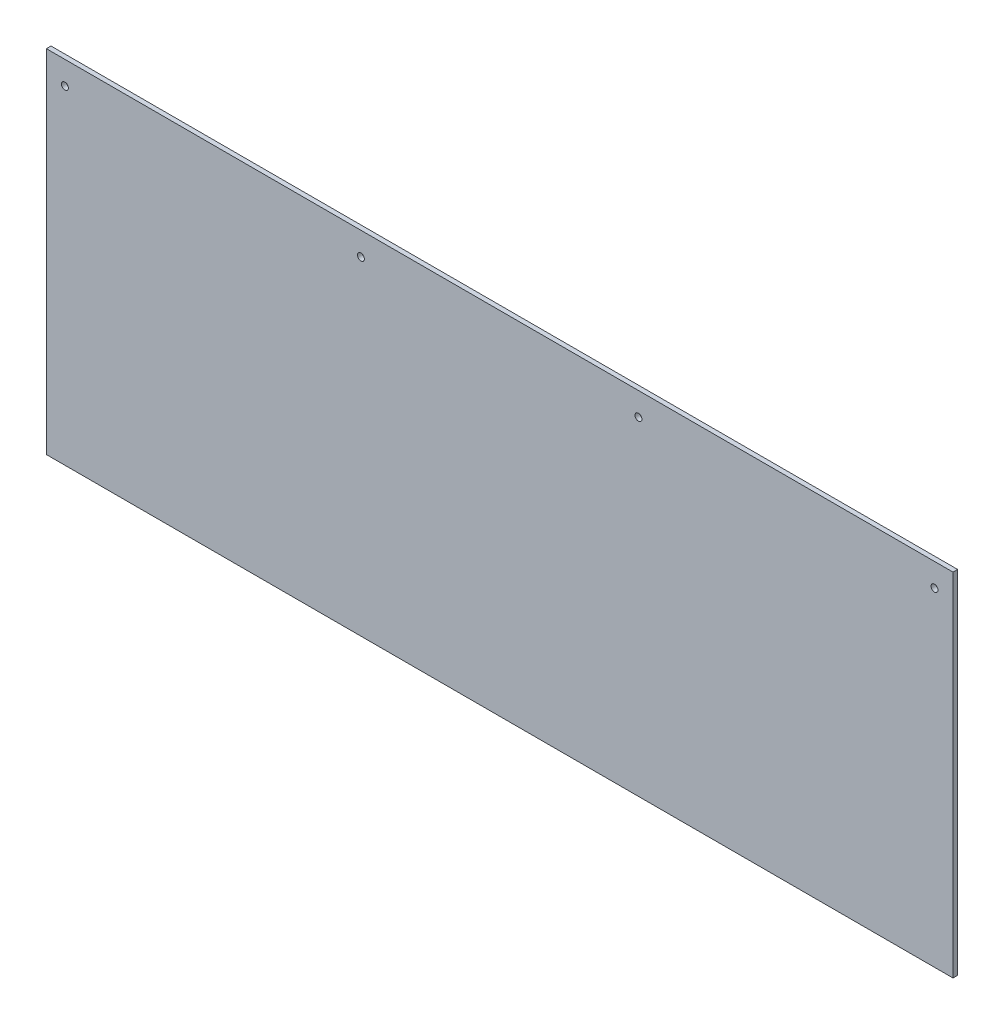
ISO-10303-21;
HEADER;
FILE_DESCRIPTION(('STEP AP214'),'2;1');
FILE_NAME('part.step','',(''),(''),'','','');
FILE_SCHEMA(('AUTOMOTIVE_DESIGN { 1 0 10303 214 1 1 1 1 }'));
ENDSEC;
DATA;
#1=APPLICATION_CONTEXT('core data for automotive mechanical design processes');
#2=APPLICATION_PROTOCOL_DEFINITION('international standard','automotive_design',2000,#1);
#3=PRODUCT_CONTEXT('',#1,'mechanical');
#4=PRODUCT('Part','Part','',(#3));
#5=PRODUCT_RELATED_PRODUCT_CATEGORY('part','',(#4));
#6=PRODUCT_DEFINITION_FORMATION('','',#4);
#7=PRODUCT_DEFINITION_CONTEXT('part definition',#1,'design');
#8=PRODUCT_DEFINITION('design','',#6,#7);
#9=PRODUCT_DEFINITION_SHAPE('','',#8);
#10=(LENGTH_UNIT() NAMED_UNIT(*) SI_UNIT(.MILLI.,.METRE.));
#11=(NAMED_UNIT(*) PLANE_ANGLE_UNIT() SI_UNIT($,.RADIAN.));
#12=(NAMED_UNIT(*) SI_UNIT($,.STERADIAN.) SOLID_ANGLE_UNIT());
#13=UNCERTAINTY_MEASURE_WITH_UNIT(LENGTH_MEASURE(1.E-05),#10,'distance_accuracy_value','');
#14=(GEOMETRIC_REPRESENTATION_CONTEXT(3) GLOBAL_UNCERTAINTY_ASSIGNED_CONTEXT((#13)) GLOBAL_UNIT_ASSIGNED_CONTEXT((#10,
#11,#12)) REPRESENTATION_CONTEXT('',''));
#15=CARTESIAN_POINT('',(0.,0.,0.));
#16=DIRECTION('',(0.,0.,1.));
#17=DIRECTION('',(1.,0.,0.));
#18=AXIS2_PLACEMENT_3D('',#15,#16,#17);
#19=CARTESIAN_POINT('',(575.146300512891,241.110246677986,0.));
#20=DIRECTION('',(0.,0.,1.));
#21=DIRECTION('',(1.,0.,0.));
#22=AXIS2_PLACEMENT_3D('',#19,#20,#21);
#23=PLANE('',#22);
#24=CARTESIAN_POINT('',(1172.04630051289,450.660246677986,0.));
#25=DIRECTION('',(0.,0.,1.));
#26=DIRECTION('',(1.,0.,0.));
#27=AXIS2_PLACEMENT_3D('',#24,#25,#26);
#28=CIRCLE('',#27,4.7625);
#29=CARTESIAN_POINT('',(1176.80880051289,450.660246677986,0.));
#30=VERTEX_POINT('',#29);
#31=EDGE_CURVE('E91',#30,#30,#28,.T.);
#32=ORIENTED_EDGE('',*,*,#31,.T.);
#33=EDGE_LOOP('',(#32));
#34=FACE_BOUND('',#33,.T.);
#35=CARTESIAN_POINT('',(765.646300512891,450.660246677986,0.));
#36=DIRECTION('',(0.,0.,1.));
#37=DIRECTION('',(1.,0.,0.));
#38=AXIS2_PLACEMENT_3D('',#35,#36,#37);
#39=CIRCLE('',#38,4.7625);
#40=CARTESIAN_POINT('',(770.408800512891,450.660246677986,0.));
#41=VERTEX_POINT('',#40);
#42=EDGE_CURVE('E95',#41,#41,#39,.T.);
#43=ORIENTED_EDGE('',*,*,#42,.T.);
#44=EDGE_LOOP('',(#43));
#45=FACE_BOUND('',#44,.T.);
#46=CARTESIAN_POINT('',(-21.7536994871086,450.660246677986,0.));
#47=DIRECTION('',(0.,0.,1.));
#48=DIRECTION('',(1.,0.,0.));
#49=AXIS2_PLACEMENT_3D('',#46,#47,#48);
#50=CIRCLE('',#49,4.7625);
#51=CARTESIAN_POINT('',(-16.9911994871086,450.660246677986,0.));
#52=VERTEX_POINT('',#51);
#53=EDGE_CURVE('E97',#52,#52,#50,.T.);
#54=ORIENTED_EDGE('',*,*,#53,.T.);
#55=EDGE_LOOP('',(#54));
#56=FACE_BOUND('',#55,.T.);
#57=CARTESIAN_POINT('',(384.646300512891,450.660246677986,0.));
#58=DIRECTION('',(0.,0.,1.));
#59=DIRECTION('',(1.,0.,0.));
#60=AXIS2_PLACEMENT_3D('',#57,#58,#59);
#61=CIRCLE('',#60,4.7625);
#62=CARTESIAN_POINT('',(389.408800512891,450.660246677986,0.));
#63=VERTEX_POINT('',#62);
#64=EDGE_CURVE('E20',#63,#63,#61,.T.);
#65=ORIENTED_EDGE('',*,*,#64,.T.);
#66=EDGE_LOOP('',(#65));
#67=FACE_BOUND('',#66,.T.);
#68=DIRECTION('',(1.,0.,0.));
#69=VECTOR('',#68,1.);
#70=CARTESIAN_POINT('',(-47.1536994871086,482.410246677986,0.));
#71=LINE('',#70,#69);
#72=CARTESIAN_POINT('',(1197.44630051289,482.410246677986,0.));
#73=VERTEX_POINT('',#72);
#74=CARTESIAN_POINT('',(-47.1536994871084,482.410246677986,0.));
#75=VERTEX_POINT('',#74);
#76=EDGE_CURVE('E57',#73,#75,#71,.F.);
#77=ORIENTED_EDGE('',*,*,#76,.F.);
#78=DIRECTION('',(0.,1.,0.));
#79=VECTOR('',#78,1.);
#80=CARTESIAN_POINT('',(1197.44630051289,482.410246677986,0.));
#81=LINE('',#80,#79);
#82=CARTESIAN_POINT('',(1197.44630051289,-0.189753322013728,0.));
#83=VERTEX_POINT('',#82);
#84=EDGE_CURVE('E59',#83,#73,#81,.T.);
#85=ORIENTED_EDGE('',*,*,#84,.F.);
#86=DIRECTION('',(1.,0.,0.));
#87=VECTOR('',#86,1.);
#88=CARTESIAN_POINT('',(1197.44630051289,-0.18975332201373,0.));
#89=LINE('',#88,#87);
#90=CARTESIAN_POINT('',(-47.1536994871084,-0.189753322013733,0.));
#91=VERTEX_POINT('',#90);
#92=EDGE_CURVE('E106',#91,#83,#89,.T.);
#93=ORIENTED_EDGE('',*,*,#92,.F.);
#94=DIRECTION('',(0.,1.,0.));
#95=VECTOR('',#94,1.);
#96=CARTESIAN_POINT('',(-47.1536994871084,-0.18975332201373,0.));
#97=LINE('',#96,#95);
#98=EDGE_CURVE('E55',#75,#91,#97,.F.);
#99=ORIENTED_EDGE('',*,*,#98,.F.);
#100=EDGE_LOOP('',(#77,#85,#93,#99));
#101=FACE_BOUND('',#100,.T.);
#102=ADVANCED_FACE('F17',(#34,#45,#56,#67,#101),#23,.F.);
#103=CARTESIAN_POINT('',(1197.44630051289,482.410246677986,0.));
#104=DIRECTION('',(1.,0.,0.));
#105=DIRECTION('',(0.,0.,-1.));
#106=AXIS2_PLACEMENT_3D('',#103,#104,#105);
#107=PLANE('',#106);
#108=DIRECTION('',(0.,1.,0.));
#109=VECTOR('',#108,1.);
#110=CARTESIAN_POINT('',(1197.44630051289,241.110246677986,6.35));
#111=LINE('',#110,#109);
#112=CARTESIAN_POINT('',(1197.44630051289,-0.189753322013721,6.35));
#113=VERTEX_POINT('',#112);
#114=CARTESIAN_POINT('',(1197.44630051289,482.410246677986,6.35));
#115=VERTEX_POINT('',#114);
#116=EDGE_CURVE('E94',#113,#115,#111,.T.);
#117=ORIENTED_EDGE('',*,*,#116,.F.);
#118=DIRECTION('',(0.,0.,-1.));
#119=VECTOR('',#118,1.);
#120=CARTESIAN_POINT('',(1197.44630051289,-0.18975332201373,0.));
#121=LINE('',#120,#119);
#122=EDGE_CURVE('E70',#83,#113,#121,.F.);
#123=ORIENTED_EDGE('',*,*,#122,.F.);
#124=ORIENTED_EDGE('',*,*,#84,.T.);
#125=DIRECTION('',(0.,0.,1.));
#126=VECTOR('',#125,1.);
#127=CARTESIAN_POINT('',(1197.44630051289,482.410246677986,0.));
#128=LINE('',#127,#126);
#129=EDGE_CURVE('E64',#115,#73,#128,.F.);
#130=ORIENTED_EDGE('',*,*,#129,.F.);
#131=EDGE_LOOP('',(#117,#123,#124,#130));
#132=FACE_BOUND('',#131,.T.);
#133=ADVANCED_FACE('F67',(#132),#107,.T.);
#134=CARTESIAN_POINT('',(-47.1536994871086,482.410246677986,0.));
#135=DIRECTION('',(0.,1.,0.));
#136=DIRECTION('',(0.,0.,1.));
#137=AXIS2_PLACEMENT_3D('',#134,#135,#136);
#138=PLANE('',#137);
#139=DIRECTION('',(1.,0.,0.));
#140=VECTOR('',#139,1.);
#141=CARTESIAN_POINT('',(575.146300512891,482.410246677986,6.35));
#142=LINE('',#141,#140);
#143=CARTESIAN_POINT('',(-47.1536994871084,482.410246677986,6.35));
#144=VERTEX_POINT('',#143);
#145=EDGE_CURVE('E75',#115,#144,#142,.F.);
#146=ORIENTED_EDGE('',*,*,#145,.F.);
#147=ORIENTED_EDGE('',*,*,#129,.T.);
#148=ORIENTED_EDGE('',*,*,#76,.T.);
#149=DIRECTION('',(0.,0.,1.));
#150=VECTOR('',#149,1.);
#151=CARTESIAN_POINT('',(-47.1536994871084,482.410246677986,0.));
#152=LINE('',#151,#150);
#153=EDGE_CURVE('E78',#144,#75,#152,.F.);
#154=ORIENTED_EDGE('',*,*,#153,.F.);
#155=EDGE_LOOP('',(#146,#147,#148,#154));
#156=FACE_BOUND('',#155,.T.);
#157=ADVANCED_FACE('F73',(#156),#138,.T.);
#158=CARTESIAN_POINT('',(-47.1536994871084,-0.18975332201373,0.));
#159=DIRECTION('',(-1.,0.,0.));
#160=DIRECTION('',(0.,0.,1.));
#161=AXIS2_PLACEMENT_3D('',#158,#159,#160);
#162=PLANE('',#161);
#163=DIRECTION('',(0.,1.,0.));
#164=VECTOR('',#163,1.);
#165=CARTESIAN_POINT('',(-47.1536994871083,241.110246677986,6.35));
#166=LINE('',#165,#164);
#167=CARTESIAN_POINT('',(-47.1536994871084,-0.189753322013732,6.35));
#168=VERTEX_POINT('',#167);
#169=EDGE_CURVE('E113',#144,#168,#166,.F.);
#170=ORIENTED_EDGE('',*,*,#169,.F.);
#171=ORIENTED_EDGE('',*,*,#153,.T.);
#172=ORIENTED_EDGE('',*,*,#98,.T.);
#173=DIRECTION('',(0.,0.,-1.));
#174=VECTOR('',#173,1.);
#175=CARTESIAN_POINT('',(-47.1536994871085,-0.18975332201373,0.));
#176=LINE('',#175,#174);
#177=EDGE_CURVE('E35',#168,#91,#176,.T.);
#178=ORIENTED_EDGE('',*,*,#177,.F.);
#179=EDGE_LOOP('',(#170,#171,#172,#178));
#180=FACE_BOUND('',#179,.T.);
#181=ADVANCED_FACE('F111',(#180),#162,.T.);
#182=CARTESIAN_POINT('',(1197.44630051289,-0.18975332201373,0.));
#183=DIRECTION('',(0.,-1.,0.));
#184=DIRECTION('',(0.,0.,-1.));
#185=AXIS2_PLACEMENT_3D('',#182,#183,#184);
#186=PLANE('',#185);
#187=DIRECTION('',(1.,0.,0.));
#188=VECTOR('',#187,1.);
#189=CARTESIAN_POINT('',(575.146300512891,-0.189753322013736,6.35));
#190=LINE('',#189,#188);
#191=EDGE_CURVE('E90',#168,#113,#190,.T.);
#192=ORIENTED_EDGE('',*,*,#191,.F.);
#193=ORIENTED_EDGE('',*,*,#177,.T.);
#194=ORIENTED_EDGE('',*,*,#92,.T.);
#195=ORIENTED_EDGE('',*,*,#122,.T.);
#196=EDGE_LOOP('',(#192,#193,#194,#195));
#197=FACE_BOUND('',#196,.T.);
#198=ADVANCED_FACE('F119',(#197),#186,.T.);
#199=CARTESIAN_POINT('',(384.646300512891,450.660246677986,0.));
#200=DIRECTION('',(0.,0.,1.));
#201=DIRECTION('',(1.,0.,0.));
#202=AXIS2_PLACEMENT_3D('',#199,#200,#201);
#203=CYLINDRICAL_SURFACE('',#202,4.7625);
#204=CARTESIAN_POINT('',(384.646300512891,450.660246677986,6.35));
#205=DIRECTION('',(0.,0.,1.));
#206=DIRECTION('',(1.,0.,0.));
#207=AXIS2_PLACEMENT_3D('',#204,#205,#206);
#208=CIRCLE('',#207,4.7625);
#209=CARTESIAN_POINT('',(389.408800512891,450.660246677986,6.35));
#210=VERTEX_POINT('',#209);
#211=EDGE_CURVE('E87',#210,#210,#208,.F.);
#212=ORIENTED_EDGE('',*,*,#211,.F.);
#213=EDGE_LOOP('',(#212));
#214=FACE_BOUND('',#213,.T.);
#215=ORIENTED_EDGE('',*,*,#64,.F.);
#216=EDGE_LOOP('',(#215));
#217=FACE_BOUND('',#216,.T.);
#218=ADVANCED_FACE('F121',(#214,#217),#203,.F.);
#219=CARTESIAN_POINT('',(-21.7536994871086,450.660246677986,0.));
#220=DIRECTION('',(0.,0.,1.));
#221=DIRECTION('',(1.,0.,0.));
#222=AXIS2_PLACEMENT_3D('',#219,#220,#221);
#223=CYLINDRICAL_SURFACE('',#222,4.7625);
#224=CARTESIAN_POINT('',(-21.7536994871086,450.660246677986,6.35));
#225=DIRECTION('',(0.,0.,1.));
#226=DIRECTION('',(1.,0.,0.));
#227=AXIS2_PLACEMENT_3D('',#224,#225,#226);
#228=CIRCLE('',#227,4.7625);
#229=CARTESIAN_POINT('',(-16.9911994871086,450.660246677986,6.35));
#230=VERTEX_POINT('',#229);
#231=EDGE_CURVE('E84',#230,#230,#228,.F.);
#232=ORIENTED_EDGE('',*,*,#231,.F.);
#233=EDGE_LOOP('',(#232));
#234=FACE_BOUND('',#233,.T.);
#235=ORIENTED_EDGE('',*,*,#53,.F.);
#236=EDGE_LOOP('',(#235));
#237=FACE_BOUND('',#236,.T.);
#238=ADVANCED_FACE('F128',(#234,#237),#223,.F.);
#239=CARTESIAN_POINT('',(765.646300512891,450.660246677986,0.));
#240=DIRECTION('',(0.,0.,1.));
#241=DIRECTION('',(1.,0.,0.));
#242=AXIS2_PLACEMENT_3D('',#239,#240,#241);
#243=CYLINDRICAL_SURFACE('',#242,4.7625);
#244=CARTESIAN_POINT('',(765.646300512891,450.660246677986,6.35));
#245=DIRECTION('',(0.,0.,1.));
#246=DIRECTION('',(1.,0.,0.));
#247=AXIS2_PLACEMENT_3D('',#244,#245,#246);
#248=CIRCLE('',#247,4.7625);
#249=CARTESIAN_POINT('',(770.408800512891,450.660246677986,6.35));
#250=VERTEX_POINT('',#249);
#251=EDGE_CURVE('E26',#250,#250,#248,.F.);
#252=ORIENTED_EDGE('',*,*,#251,.F.);
#253=EDGE_LOOP('',(#252));
#254=FACE_BOUND('',#253,.T.);
#255=ORIENTED_EDGE('',*,*,#42,.F.);
#256=EDGE_LOOP('',(#255));
#257=FACE_BOUND('',#256,.T.);
#258=ADVANCED_FACE('F139',(#254,#257),#243,.F.);
#259=CARTESIAN_POINT('',(1172.04630051289,450.660246677986,0.));
#260=DIRECTION('',(0.,0.,1.));
#261=DIRECTION('',(1.,0.,0.));
#262=AXIS2_PLACEMENT_3D('',#259,#260,#261);
#263=CYLINDRICAL_SURFACE('',#262,4.7625);
#264=CARTESIAN_POINT('',(1172.04630051289,450.660246677986,6.35));
#265=DIRECTION('',(0.,0.,1.));
#266=DIRECTION('',(1.,0.,0.));
#267=AXIS2_PLACEMENT_3D('',#264,#265,#266);
#268=CIRCLE('',#267,4.7625);
#269=CARTESIAN_POINT('',(1176.80880051289,450.660246677986,6.35));
#270=VERTEX_POINT('',#269);
#271=EDGE_CURVE('E11',#270,#270,#268,.F.);
#272=ORIENTED_EDGE('',*,*,#271,.F.);
#273=EDGE_LOOP('',(#272));
#274=FACE_BOUND('',#273,.T.);
#275=ORIENTED_EDGE('',*,*,#31,.F.);
#276=EDGE_LOOP('',(#275));
#277=FACE_BOUND('',#276,.T.);
#278=ADVANCED_FACE('F133',(#274,#277),#263,.F.);
#279=CARTESIAN_POINT('',(575.146300512891,241.110246677986,6.35));
#280=DIRECTION('',(0.,0.,1.));
#281=DIRECTION('',(1.,0.,0.));
#282=AXIS2_PLACEMENT_3D('',#279,#280,#281);
#283=PLANE('',#282);
#284=ORIENTED_EDGE('',*,*,#271,.T.);
#285=EDGE_LOOP('',(#284));
#286=FACE_BOUND('',#285,.T.);
#287=ORIENTED_EDGE('',*,*,#251,.T.);
#288=EDGE_LOOP('',(#287));
#289=FACE_BOUND('',#288,.T.);
#290=ORIENTED_EDGE('',*,*,#231,.T.);
#291=EDGE_LOOP('',(#290));
#292=FACE_BOUND('',#291,.T.);
#293=ORIENTED_EDGE('',*,*,#211,.T.);
#294=EDGE_LOOP('',(#293));
#295=FACE_BOUND('',#294,.T.);
#296=ORIENTED_EDGE('',*,*,#169,.T.);
#297=ORIENTED_EDGE('',*,*,#191,.T.);
#298=ORIENTED_EDGE('',*,*,#116,.T.);
#299=ORIENTED_EDGE('',*,*,#145,.T.);
#300=EDGE_LOOP('',(#296,#297,#298,#299));
#301=FACE_BOUND('',#300,.T.);
#302=ADVANCED_FACE('F117',(#286,#289,#292,#295,#301),#283,.T.);
#303=CLOSED_SHELL('',(#102,#133,#157,#181,#198,#218,#238,#258,#278,#302));
#304=MANIFOLD_SOLID_BREP('B1',#303);
#305=ADVANCED_BREP_SHAPE_REPRESENTATION('',(#18,#304),#14);
#306=SHAPE_DEFINITION_REPRESENTATION(#9,#305);
ENDSEC;
END-ISO-10303-21;
